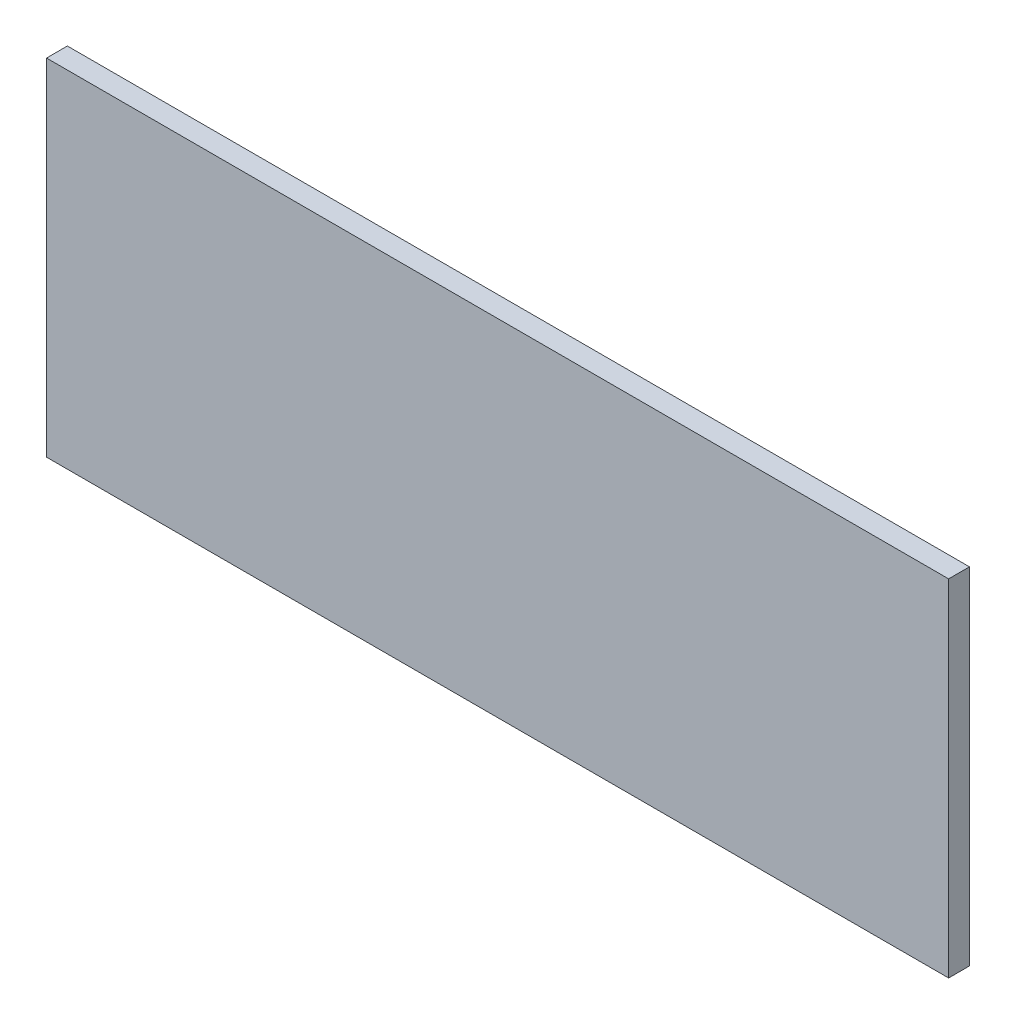
ISO-10303-21;
HEADER;
FILE_DESCRIPTION(('STEP AP214'),'2;1');
FILE_NAME('part.step','',(''),(''),'','','');
FILE_SCHEMA(('AUTOMOTIVE_DESIGN { 1 0 10303 214 1 1 1 1 }'));
ENDSEC;
DATA;
#1=APPLICATION_CONTEXT('core data for automotive mechanical design processes');
#2=APPLICATION_PROTOCOL_DEFINITION('international standard','automotive_design',2000,#1);
#3=PRODUCT_CONTEXT('',#1,'mechanical');
#4=PRODUCT('Part','Part','',(#3));
#5=PRODUCT_RELATED_PRODUCT_CATEGORY('part','',(#4));
#6=PRODUCT_DEFINITION_FORMATION('','',#4);
#7=PRODUCT_DEFINITION_CONTEXT('part definition',#1,'design');
#8=PRODUCT_DEFINITION('design','',#6,#7);
#9=PRODUCT_DEFINITION_SHAPE('','',#8);
#10=(LENGTH_UNIT() NAMED_UNIT(*) SI_UNIT(.MILLI.,.METRE.));
#11=(NAMED_UNIT(*) PLANE_ANGLE_UNIT() SI_UNIT($,.RADIAN.));
#12=(NAMED_UNIT(*) SI_UNIT($,.STERADIAN.) SOLID_ANGLE_UNIT());
#13=UNCERTAINTY_MEASURE_WITH_UNIT(LENGTH_MEASURE(1.E-05),#10,'distance_accuracy_value','');
#14=(GEOMETRIC_REPRESENTATION_CONTEXT(3) GLOBAL_UNCERTAINTY_ASSIGNED_CONTEXT((#13)) GLOBAL_UNIT_ASSIGNED_CONTEXT((#10,
#11,#12)) REPRESENTATION_CONTEXT('',''));
#15=CARTESIAN_POINT('',(0.,0.,0.));
#16=DIRECTION('',(0.,0.,1.));
#17=DIRECTION('',(1.,0.,0.));
#18=AXIS2_PLACEMENT_3D('',#15,#16,#17);
#19=CARTESIAN_POINT('',(-389.5,-149.25,18.));
#20=DIRECTION('',(1.,0.,0.));
#21=DIRECTION('',(0.,0.,-1.));
#22=AXIS2_PLACEMENT_3D('',#19,#20,#21);
#23=PLANE('',#22);
#24=DIRECTION('',(0.,-1.,0.));
#25=VECTOR('',#24,1.);
#26=CARTESIAN_POINT('',(-389.5,-149.25,0.));
#27=LINE('',#26,#25);
#28=CARTESIAN_POINT('',(-389.5,149.25,0.));
#29=VERTEX_POINT('',#28);
#30=CARTESIAN_POINT('',(-389.5,-149.25,0.));
#31=VERTEX_POINT('',#30);
#32=EDGE_CURVE('E96',#29,#31,#27,.T.);
#33=ORIENTED_EDGE('',*,*,#32,.T.);
#34=DIRECTION('',(0.,0.,-1.));
#35=VECTOR('',#34,1.);
#36=CARTESIAN_POINT('',(-389.5,-149.25,18.));
#37=LINE('',#36,#35);
#38=CARTESIAN_POINT('',(-389.5,-149.25,18.));
#39=VERTEX_POINT('',#38);
#40=EDGE_CURVE('E11',#39,#31,#37,.T.);
#41=ORIENTED_EDGE('',*,*,#40,.F.);
#42=DIRECTION('',(0.,-1.,0.));
#43=VECTOR('',#42,1.);
#44=CARTESIAN_POINT('',(-389.5,-149.25,18.));
#45=LINE('',#44,#43);
#46=CARTESIAN_POINT('',(-389.5,149.25,18.));
#47=VERTEX_POINT('',#46);
#48=EDGE_CURVE('E84',#47,#39,#45,.T.);
#49=ORIENTED_EDGE('',*,*,#48,.F.);
#50=DIRECTION('',(0.,0.,-1.));
#51=VECTOR('',#50,1.);
#52=CARTESIAN_POINT('',(-389.5,149.25,18.));
#53=LINE('',#52,#51);
#54=EDGE_CURVE('E92',#47,#29,#53,.T.);
#55=ORIENTED_EDGE('',*,*,#54,.T.);
#56=EDGE_LOOP('',(#33,#41,#49,#55));
#57=FACE_BOUND('',#56,.T.);
#58=ADVANCED_FACE('F33',(#57),#23,.F.);
#59=CARTESIAN_POINT('',(389.5,-149.25,18.));
#60=DIRECTION('',(0.,1.,0.));
#61=DIRECTION('',(-1.,0.,0.));
#62=AXIS2_PLACEMENT_3D('',#59,#60,#61);
#63=PLANE('',#62);
#64=DIRECTION('',(1.,0.,0.));
#65=VECTOR('',#64,1.);
#66=CARTESIAN_POINT('',(389.5,-149.25,0.));
#67=LINE('',#66,#65);
#68=CARTESIAN_POINT('',(389.5,-149.25,0.));
#69=VERTEX_POINT('',#68);
#70=EDGE_CURVE('E88',#31,#69,#67,.T.);
#71=ORIENTED_EDGE('',*,*,#70,.T.);
#72=DIRECTION('',(0.,0.,-1.));
#73=VECTOR('',#72,1.);
#74=CARTESIAN_POINT('',(389.5,-149.25,18.));
#75=LINE('',#74,#73);
#76=CARTESIAN_POINT('',(389.5,-149.25,18.));
#77=VERTEX_POINT('',#76);
#78=EDGE_CURVE('E41',#77,#69,#75,.T.);
#79=ORIENTED_EDGE('',*,*,#78,.F.);
#80=DIRECTION('',(1.,0.,0.));
#81=VECTOR('',#80,1.);
#82=CARTESIAN_POINT('',(389.5,-149.25,18.));
#83=LINE('',#82,#81);
#84=EDGE_CURVE('E79',#39,#77,#83,.T.);
#85=ORIENTED_EDGE('',*,*,#84,.F.);
#86=ORIENTED_EDGE('',*,*,#40,.T.);
#87=EDGE_LOOP('',(#71,#79,#85,#86));
#88=FACE_BOUND('',#87,.T.);
#89=ADVANCED_FACE('F87',(#88),#63,.F.);
#90=CARTESIAN_POINT('',(389.5,-149.25,18.));
#91=DIRECTION('',(-1.,0.,0.));
#92=DIRECTION('',(0.,0.,1.));
#93=AXIS2_PLACEMENT_3D('',#90,#91,#92);
#94=PLANE('',#93);
#95=DIRECTION('',(0.,1.,0.));
#96=VECTOR('',#95,1.);
#97=CARTESIAN_POINT('',(389.5,-149.25,0.));
#98=LINE('',#97,#96);
#99=CARTESIAN_POINT('',(389.5,149.25,0.));
#100=VERTEX_POINT('',#99);
#101=EDGE_CURVE('E66',#69,#100,#98,.T.);
#102=ORIENTED_EDGE('',*,*,#101,.T.);
#103=DIRECTION('',(0.,0.,-1.));
#104=VECTOR('',#103,1.);
#105=CARTESIAN_POINT('',(389.5,149.25,18.));
#106=LINE('',#105,#104);
#107=CARTESIAN_POINT('',(389.5,149.25,18.));
#108=VERTEX_POINT('',#107);
#109=EDGE_CURVE('E89',#108,#100,#106,.T.);
#110=ORIENTED_EDGE('',*,*,#109,.F.);
#111=DIRECTION('',(0.,1.,0.));
#112=VECTOR('',#111,1.);
#113=CARTESIAN_POINT('',(389.5,-149.25,18.));
#114=LINE('',#113,#112);
#115=EDGE_CURVE('E82',#77,#108,#114,.T.);
#116=ORIENTED_EDGE('',*,*,#115,.F.);
#117=ORIENTED_EDGE('',*,*,#78,.T.);
#118=EDGE_LOOP('',(#102,#110,#116,#117));
#119=FACE_BOUND('',#118,.T.);
#120=ADVANCED_FACE('F90',(#119),#94,.F.);
#121=CARTESIAN_POINT('',(389.5,149.25,18.));
#122=DIRECTION('',(0.,-1.,0.));
#123=DIRECTION('',(1.,0.,0.));
#124=AXIS2_PLACEMENT_3D('',#121,#122,#123);
#125=PLANE('',#124);
#126=DIRECTION('',(-1.,0.,0.));
#127=VECTOR('',#126,1.);
#128=CARTESIAN_POINT('',(389.5,149.25,0.));
#129=LINE('',#128,#127);
#130=EDGE_CURVE('E72',#100,#29,#129,.T.);
#131=ORIENTED_EDGE('',*,*,#130,.T.);
#132=ORIENTED_EDGE('',*,*,#54,.F.);
#133=DIRECTION('',(-1.,0.,0.));
#134=VECTOR('',#133,1.);
#135=CARTESIAN_POINT('',(389.5,149.25,18.));
#136=LINE('',#135,#134);
#137=EDGE_CURVE('E49',#108,#47,#136,.T.);
#138=ORIENTED_EDGE('',*,*,#137,.F.);
#139=ORIENTED_EDGE('',*,*,#109,.T.);
#140=EDGE_LOOP('',(#131,#132,#138,#139));
#141=FACE_BOUND('',#140,.T.);
#142=ADVANCED_FACE('F103',(#141),#125,.F.);
#143=CARTESIAN_POINT('',(0.,0.,18.));
#144=DIRECTION('',(0.,0.,1.));
#145=DIRECTION('',(1.,0.,0.));
#146=AXIS2_PLACEMENT_3D('',#143,#144,#145);
#147=PLANE('',#146);
#148=ORIENTED_EDGE('',*,*,#48,.T.);
#149=ORIENTED_EDGE('',*,*,#84,.T.);
#150=ORIENTED_EDGE('',*,*,#115,.T.);
#151=ORIENTED_EDGE('',*,*,#137,.T.);
#152=EDGE_LOOP('',(#148,#149,#150,#151));
#153=FACE_BOUND('',#152,.T.);
#154=ADVANCED_FACE('F80',(#153),#147,.T.);
#155=CARTESIAN_POINT('',(0.,0.,0.));
#156=DIRECTION('',(0.,0.,1.));
#157=DIRECTION('',(1.,0.,0.));
#158=AXIS2_PLACEMENT_3D('',#155,#156,#157);
#159=PLANE('',#158);
#160=ORIENTED_EDGE('',*,*,#32,.F.);
#161=ORIENTED_EDGE('',*,*,#130,.F.);
#162=ORIENTED_EDGE('',*,*,#101,.F.);
#163=ORIENTED_EDGE('',*,*,#70,.F.);
#164=EDGE_LOOP('',(#160,#161,#162,#163));
#165=FACE_BOUND('',#164,.T.);
#166=ADVANCED_FACE('F106',(#165),#159,.F.);
#167=CLOSED_SHELL('',(#58,#89,#120,#142,#154,#166));
#168=MANIFOLD_SOLID_BREP('B2',#167);
#169=ADVANCED_BREP_SHAPE_REPRESENTATION('',(#18,#168),#14);
#170=SHAPE_DEFINITION_REPRESENTATION(#9,#169);
ENDSEC;
END-ISO-10303-21;
